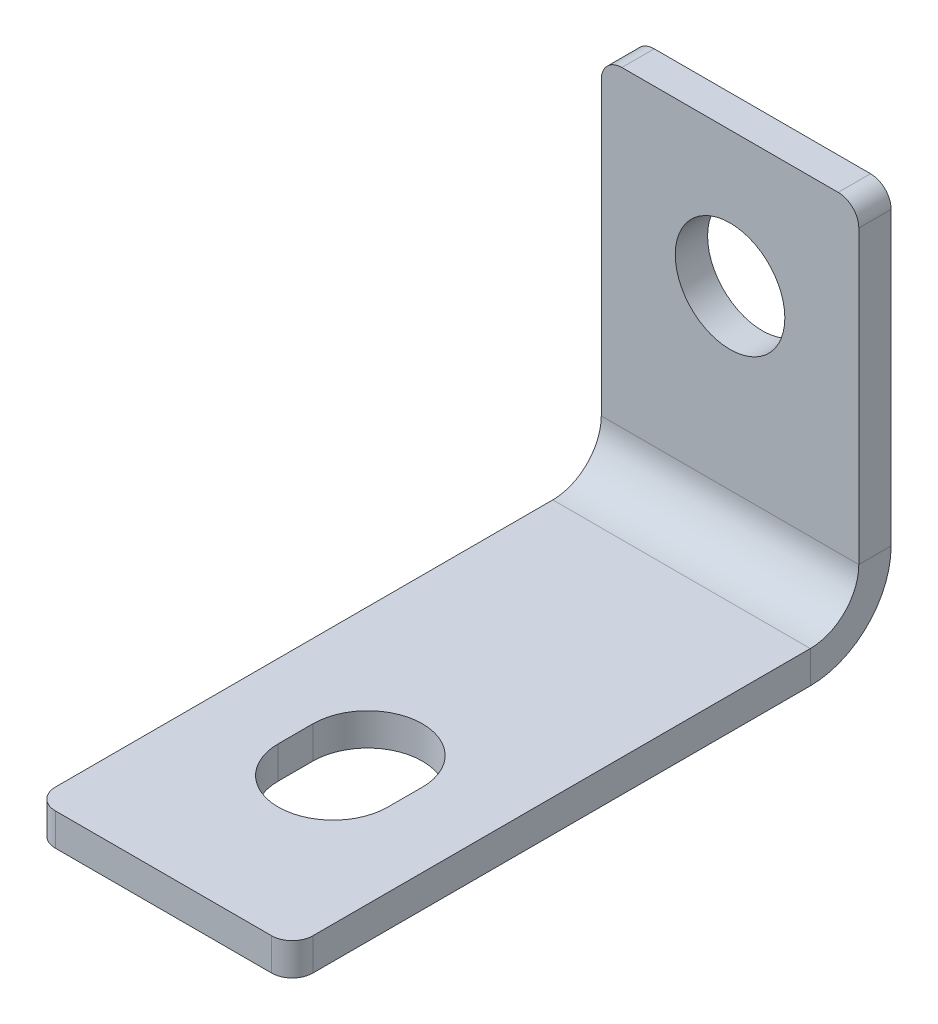
ISO-10303-21;
HEADER;
FILE_DESCRIPTION(('STEP AP214'),'2;1');
FILE_NAME('part.step','',(''),(''),'','','');
FILE_SCHEMA(('AUTOMOTIVE_DESIGN { 1 0 10303 214 1 1 1 1 }'));
ENDSEC;
DATA;
#1=APPLICATION_CONTEXT('core data for automotive mechanical design processes');
#2=APPLICATION_PROTOCOL_DEFINITION('international standard','automotive_design',2000,#1);
#3=PRODUCT_CONTEXT('',#1,'mechanical');
#4=PRODUCT('Part','Part','',(#3));
#5=PRODUCT_RELATED_PRODUCT_CATEGORY('part','',(#4));
#6=PRODUCT_DEFINITION_FORMATION('','',#4);
#7=PRODUCT_DEFINITION_CONTEXT('part definition',#1,'design');
#8=PRODUCT_DEFINITION('design','',#6,#7);
#9=PRODUCT_DEFINITION_SHAPE('','',#8);
#10=(LENGTH_UNIT() NAMED_UNIT(*) SI_UNIT(.MILLI.,.METRE.));
#11=(NAMED_UNIT(*) PLANE_ANGLE_UNIT() SI_UNIT($,.RADIAN.));
#12=(NAMED_UNIT(*) SI_UNIT($,.STERADIAN.) SOLID_ANGLE_UNIT());
#13=UNCERTAINTY_MEASURE_WITH_UNIT(LENGTH_MEASURE(1.E-05),#10,'distance_accuracy_value','');
#14=(GEOMETRIC_REPRESENTATION_CONTEXT(3) GLOBAL_UNCERTAINTY_ASSIGNED_CONTEXT((#13)) GLOBAL_UNIT_ASSIGNED_CONTEXT((#10,
#11,#12)) REPRESENTATION_CONTEXT('',''));
#15=CARTESIAN_POINT('',(0.,0.,0.));
#16=DIRECTION('',(0.,0.,1.));
#17=DIRECTION('',(1.,0.,0.));
#18=AXIS2_PLACEMENT_3D('',#15,#16,#17);
#19=CARTESIAN_POINT('',(15.875,2.99085,0.));
#20=DIRECTION('',(1.,0.,0.));
#21=DIRECTION('',(0.,0.,-1.));
#22=AXIS2_PLACEMENT_3D('',#19,#20,#21);
#23=PLANE('',#22);
#24=DIRECTION('',(0.,0.,-1.));
#25=VECTOR('',#24,1.);
#26=CARTESIAN_POINT('',(15.875,2.99085,0.));
#27=LINE('',#26,#25);
#28=CARTESIAN_POINT('',(15.875,2.99085,0.));
#29=VERTEX_POINT('',#28);
#30=CARTESIAN_POINT('',(15.875,2.99085,-1.9939));
#31=VERTEX_POINT('',#30);
#32=EDGE_CURVE('E334',#29,#31,#27,.T.);
#33=ORIENTED_EDGE('',*,*,#32,.F.);
#34=CARTESIAN_POINT('',(15.875,2.99085,2.99085));
#35=DIRECTION('',(-1.,0.,0.));
#36=DIRECTION('',(0.,0.,1.));
#37=AXIS2_PLACEMENT_3D('',#34,#35,#36);
#38=CIRCLE('',#37,2.99085);
#39=CARTESIAN_POINT('',(15.875,0.,2.99085));
#40=VERTEX_POINT('',#39);
#41=EDGE_CURVE('E279',#40,#29,#38,.F.);
#42=ORIENTED_EDGE('',*,*,#41,.F.);
#43=DIRECTION('',(0.,1.,0.));
#44=VECTOR('',#43,1.);
#45=CARTESIAN_POINT('',(15.875,-1.9939,2.99085000000001));
#46=LINE('',#45,#44);
#47=CARTESIAN_POINT('',(15.875,-1.9939,2.99085000000001));
#48=VERTEX_POINT('',#47);
#49=EDGE_CURVE('E331',#48,#40,#46,.T.);
#50=ORIENTED_EDGE('',*,*,#49,.F.);
#51=CARTESIAN_POINT('',(15.875,2.99085,2.99085));
#52=DIRECTION('',(1.,0.,0.));
#53=DIRECTION('',(0.,0.,-1.));
#54=AXIS2_PLACEMENT_3D('',#51,#52,#53);
#55=CIRCLE('',#54,4.98475);
#56=EDGE_CURVE('E286',#48,#31,#55,.T.);
#57=ORIENTED_EDGE('',*,*,#56,.T.);
#58=EDGE_LOOP('',(#33,#42,#50,#57));
#59=FACE_BOUND('',#58,.T.);
#60=ADVANCED_FACE('F112',(#59),#23,.T.);
#61=CARTESIAN_POINT('',(15.875,-1.9939,2.99085000000001));
#62=DIRECTION('',(1.,0.,0.));
#63=DIRECTION('',(0.,0.,-1.));
#64=AXIS2_PLACEMENT_3D('',#61,#62,#63);
#65=PLANE('',#64);
#66=DIRECTION('',(0.,1.,0.));
#67=VECTOR('',#66,1.);
#68=CARTESIAN_POINT('',(15.875,0.,-1.9939));
#69=LINE('',#68,#67);
#70=CARTESIAN_POINT('',(15.875,20.955,-1.9939));
#71=VERTEX_POINT('',#70);
#72=EDGE_CURVE('E272',#31,#71,#69,.T.);
#73=ORIENTED_EDGE('',*,*,#72,.T.);
#74=DIRECTION('',(0.,0.,-1.));
#75=VECTOR('',#74,1.);
#76=CARTESIAN_POINT('',(15.875,20.955,2.99085000000001));
#77=LINE('',#76,#75);
#78=CARTESIAN_POINT('',(15.875,20.955,0.));
#79=VERTEX_POINT('',#78);
#80=EDGE_CURVE('E345',#71,#79,#77,.F.);
#81=ORIENTED_EDGE('',*,*,#80,.T.);
#82=DIRECTION('',(0.,1.,0.));
#83=VECTOR('',#82,1.);
#84=CARTESIAN_POINT('',(15.875,0.,0.));
#85=LINE('',#84,#83);
#86=EDGE_CURVE('E275',#29,#79,#85,.T.);
#87=ORIENTED_EDGE('',*,*,#86,.F.);
#88=ORIENTED_EDGE('',*,*,#32,.T.);
#89=EDGE_LOOP('',(#73,#81,#87,#88));
#90=FACE_BOUND('',#89,.T.);
#91=ADVANCED_FACE('F404',(#90),#65,.T.);
#92=CARTESIAN_POINT('',(0.,0.,2.99085));
#93=DIRECTION('',(-1.,0.,0.));
#94=DIRECTION('',(0.,0.,1.));
#95=AXIS2_PLACEMENT_3D('',#92,#93,#94);
#96=PLANE('',#95);
#97=DIRECTION('',(0.,-1.,0.));
#98=VECTOR('',#97,1.);
#99=CARTESIAN_POINT('',(0.,0.,2.99085));
#100=LINE('',#99,#98);
#101=CARTESIAN_POINT('',(0.,0.,2.99085));
#102=VERTEX_POINT('',#101);
#103=CARTESIAN_POINT('',(0.,-1.9939,2.99085000000001));
#104=VERTEX_POINT('',#103);
#105=EDGE_CURVE('E328',#102,#104,#100,.T.);
#106=ORIENTED_EDGE('',*,*,#105,.F.);
#107=CARTESIAN_POINT('',(0.,2.99085,2.99085));
#108=DIRECTION('',(-1.,0.,0.));
#109=DIRECTION('',(0.,0.,1.));
#110=AXIS2_PLACEMENT_3D('',#107,#108,#109);
#111=CIRCLE('',#110,2.99085);
#112=CARTESIAN_POINT('',(0.,2.99085,0.));
#113=VERTEX_POINT('',#112);
#114=EDGE_CURVE('E295',#102,#113,#111,.F.);
#115=ORIENTED_EDGE('',*,*,#114,.T.);
#116=DIRECTION('',(0.,0.,1.));
#117=VECTOR('',#116,1.);
#118=CARTESIAN_POINT('',(0.,2.99085,-1.9939));
#119=LINE('',#118,#117);
#120=CARTESIAN_POINT('',(0.,2.99085,-1.9939));
#121=VERTEX_POINT('',#120);
#122=EDGE_CURVE('E326',#121,#113,#119,.T.);
#123=ORIENTED_EDGE('',*,*,#122,.F.);
#124=CARTESIAN_POINT('',(0.,2.99085,2.99085));
#125=DIRECTION('',(1.,0.,0.));
#126=DIRECTION('',(0.,0.,-1.));
#127=AXIS2_PLACEMENT_3D('',#124,#125,#126);
#128=CIRCLE('',#127,4.98475);
#129=EDGE_CURVE('E276',#104,#121,#128,.T.);
#130=ORIENTED_EDGE('',*,*,#129,.F.);
#131=EDGE_LOOP('',(#106,#115,#123,#130));
#132=FACE_BOUND('',#131,.T.);
#133=ADVANCED_FACE('F381',(#132),#96,.T.);
#134=CARTESIAN_POINT('',(0.,2.99085,-1.9939));
#135=DIRECTION('',(-1.,0.,0.));
#136=DIRECTION('',(0.,0.,1.));
#137=AXIS2_PLACEMENT_3D('',#134,#135,#136);
#138=PLANE('',#137);
#139=DIRECTION('',(0.,0.,-1.));
#140=VECTOR('',#139,1.);
#141=CARTESIAN_POINT('',(0.,-1.9939,34.925));
#142=LINE('',#141,#140);
#143=CARTESIAN_POINT('',(0.,-1.9939,33.655));
#144=VERTEX_POINT('',#143);
#145=EDGE_CURVE('E300',#144,#104,#142,.T.);
#146=ORIENTED_EDGE('',*,*,#145,.F.);
#147=DIRECTION('',(0.,1.,0.));
#148=VECTOR('',#147,1.);
#149=CARTESIAN_POINT('',(0.,2.99085,33.655));
#150=LINE('',#149,#148);
#151=CARTESIAN_POINT('',(0.,0.,33.655));
#152=VERTEX_POINT('',#151);
#153=EDGE_CURVE('E120',#144,#152,#150,.T.);
#154=ORIENTED_EDGE('',*,*,#153,.T.);
#155=DIRECTION('',(0.,0.,-1.));
#156=VECTOR('',#155,1.);
#157=CARTESIAN_POINT('',(0.,0.,34.925));
#158=LINE('',#157,#156);
#159=EDGE_CURVE('E298',#152,#102,#158,.T.);
#160=ORIENTED_EDGE('',*,*,#159,.T.);
#161=ORIENTED_EDGE('',*,*,#105,.T.);
#162=EDGE_LOOP('',(#146,#154,#160,#161));
#163=FACE_BOUND('',#162,.T.);
#164=ADVANCED_FACE('F367',(#163),#138,.T.);
#165=CARTESIAN_POINT('',(15.875,0.,-1.9939));
#166=DIRECTION('',(0.,0.,1.));
#167=DIRECTION('',(1.,0.,0.));
#168=AXIS2_PLACEMENT_3D('',#165,#166,#167);
#169=PLANE('',#168);
#170=CARTESIAN_POINT('',(7.9375,13.8811,-1.9939));
#171=DIRECTION('',(0.,0.,-1.));
#172=DIRECTION('',(-1.,0.,0.));
#173=AXIS2_PLACEMENT_3D('',#170,#171,#172);
#174=CIRCLE('',#173,3.37819999999999);
#175=CARTESIAN_POINT('',(4.55930000000001,13.8811,-1.9939));
#176=VERTEX_POINT('',#175);
#177=EDGE_CURVE('E265',#176,#176,#174,.T.);
#178=ORIENTED_EDGE('',*,*,#177,.F.);
#179=EDGE_LOOP('',(#178));
#180=FACE_BOUND('',#179,.T.);
#181=DIRECTION('',(-1.,0.,0.));
#182=VECTOR('',#181,1.);
#183=CARTESIAN_POINT('',(15.875,22.225,-1.9939));
#184=LINE('',#183,#182);
#185=CARTESIAN_POINT('',(14.605,22.225,-1.9939));
#186=VERTEX_POINT('',#185);
#187=CARTESIAN_POINT('',(1.27,22.225,-1.9939));
#188=VERTEX_POINT('',#187);
#189=EDGE_CURVE('E323',#186,#188,#184,.T.);
#190=ORIENTED_EDGE('',*,*,#189,.F.);
#191=CARTESIAN_POINT('',(14.605,20.955,-1.9939));
#192=DIRECTION('',(0.,0.,1.));
#193=DIRECTION('',(1.,0.,0.));
#194=AXIS2_PLACEMENT_3D('',#191,#192,#193);
#195=CIRCLE('',#194,1.27);
#196=EDGE_CURVE('E343',#186,#71,#195,.F.);
#197=ORIENTED_EDGE('',*,*,#196,.T.);
#198=ORIENTED_EDGE('',*,*,#72,.F.);
#199=DIRECTION('',(-1.,0.,0.));
#200=VECTOR('',#199,1.);
#201=CARTESIAN_POINT('',(15.875,2.99085,-1.9939));
#202=LINE('',#201,#200);
#203=EDGE_CURVE('E289',#31,#121,#202,.T.);
#204=ORIENTED_EDGE('',*,*,#203,.T.);
#205=DIRECTION('',(0.,1.,0.));
#206=VECTOR('',#205,1.);
#207=CARTESIAN_POINT('',(0.,0.,-1.9939));
#208=LINE('',#207,#206);
#209=CARTESIAN_POINT('',(0.,20.955,-1.9939));
#210=VERTEX_POINT('',#209);
#211=EDGE_CURVE('E271',#121,#210,#208,.T.);
#212=ORIENTED_EDGE('',*,*,#211,.T.);
#213=CARTESIAN_POINT('',(1.27,20.955,-1.9939));
#214=DIRECTION('',(0.,0.,1.));
#215=DIRECTION('',(1.,0.,0.));
#216=AXIS2_PLACEMENT_3D('',#213,#214,#215);
#217=CIRCLE('',#216,1.27);
#218=EDGE_CURVE('E341',#210,#188,#217,.F.);
#219=ORIENTED_EDGE('',*,*,#218,.T.);
#220=EDGE_LOOP('',(#190,#197,#198,#204,#212,#219));
#221=FACE_BOUND('',#220,.T.);
#222=ADVANCED_FACE('F422',(#180,#221),#169,.F.);
#223=CARTESIAN_POINT('',(15.875,22.225,0.));
#224=DIRECTION('',(0.,1.,0.));
#225=DIRECTION('',(0.,0.,1.));
#226=AXIS2_PLACEMENT_3D('',#223,#224,#225);
#227=PLANE('',#226);
#228=DIRECTION('',(-1.,0.,0.));
#229=VECTOR('',#228,1.);
#230=CARTESIAN_POINT('',(15.875,22.225,0.));
#231=LINE('',#230,#229);
#232=CARTESIAN_POINT('',(14.605,22.225,0.));
#233=VERTEX_POINT('',#232);
#234=CARTESIAN_POINT('',(1.27,22.225,0.));
#235=VERTEX_POINT('',#234);
#236=EDGE_CURVE('E320',#233,#235,#231,.T.);
#237=ORIENTED_EDGE('',*,*,#236,.F.);
#238=DIRECTION('',(0.,0.,-1.));
#239=VECTOR('',#238,1.);
#240=CARTESIAN_POINT('',(14.605,22.225,0.));
#241=LINE('',#240,#239);
#242=EDGE_CURVE('E338',#233,#186,#241,.T.);
#243=ORIENTED_EDGE('',*,*,#242,.T.);
#244=ORIENTED_EDGE('',*,*,#189,.T.);
#245=DIRECTION('',(0.,0.,-1.));
#246=VECTOR('',#245,1.);
#247=CARTESIAN_POINT('',(1.27,22.225,0.));
#248=LINE('',#247,#246);
#249=EDGE_CURVE('E336',#188,#235,#248,.F.);
#250=ORIENTED_EDGE('',*,*,#249,.T.);
#251=EDGE_LOOP('',(#237,#243,#244,#250));
#252=FACE_BOUND('',#251,.T.);
#253=ADVANCED_FACE('F413',(#252),#227,.T.);
#254=CARTESIAN_POINT('',(15.875,0.,0.));
#255=DIRECTION('',(0.,0.,1.));
#256=DIRECTION('',(1.,0.,0.));
#257=AXIS2_PLACEMENT_3D('',#254,#255,#256);
#258=PLANE('',#257);
#259=CARTESIAN_POINT('',(7.9375,13.8811,0.));
#260=DIRECTION('',(0.,0.,1.));
#261=DIRECTION('',(1.,0.,0.));
#262=AXIS2_PLACEMENT_3D('',#259,#260,#261);
#263=CIRCLE('',#262,3.37819999999999);
#264=CARTESIAN_POINT('',(11.3157,13.8811,0.));
#265=VERTEX_POINT('',#264);
#266=EDGE_CURVE('E268',#265,#265,#263,.T.);
#267=ORIENTED_EDGE('',*,*,#266,.F.);
#268=EDGE_LOOP('',(#267));
#269=FACE_BOUND('',#268,.T.);
#270=ORIENTED_EDGE('',*,*,#86,.T.);
#271=CARTESIAN_POINT('',(14.605,20.955,0.));
#272=DIRECTION('',(0.,0.,1.));
#273=DIRECTION('',(1.,0.,0.));
#274=AXIS2_PLACEMENT_3D('',#271,#272,#273);
#275=CIRCLE('',#274,1.27);
#276=EDGE_CURVE('E349',#79,#233,#275,.T.);
#277=ORIENTED_EDGE('',*,*,#276,.T.);
#278=ORIENTED_EDGE('',*,*,#236,.T.);
#279=CARTESIAN_POINT('',(1.27,20.955,0.));
#280=DIRECTION('',(0.,0.,1.));
#281=DIRECTION('',(1.,0.,0.));
#282=AXIS2_PLACEMENT_3D('',#279,#280,#281);
#283=CIRCLE('',#282,1.27);
#284=CARTESIAN_POINT('',(0.,20.955,0.));
#285=VERTEX_POINT('',#284);
#286=EDGE_CURVE('E347',#235,#285,#283,.T.);
#287=ORIENTED_EDGE('',*,*,#286,.T.);
#288=DIRECTION('',(0.,1.,0.));
#289=VECTOR('',#288,1.);
#290=CARTESIAN_POINT('',(0.,0.,0.));
#291=LINE('',#290,#289);
#292=EDGE_CURVE('E292',#113,#285,#291,.T.);
#293=ORIENTED_EDGE('',*,*,#292,.F.);
#294=DIRECTION('',(-1.,0.,0.));
#295=VECTOR('',#294,1.);
#296=CARTESIAN_POINT('',(15.875,2.99085,0.));
#297=LINE('',#296,#295);
#298=EDGE_CURVE('E317',#29,#113,#297,.T.);
#299=ORIENTED_EDGE('',*,*,#298,.F.);
#300=EDGE_LOOP('',(#270,#277,#278,#287,#293,#299));
#301=FACE_BOUND('',#300,.T.);
#302=ADVANCED_FACE('F402',(#269,#301),#258,.T.);
#303=CARTESIAN_POINT('',(15.875,2.99085,2.99085));
#304=DIRECTION('',(-1.,0.,0.));
#305=DIRECTION('',(0.,0.,1.));
#306=AXIS2_PLACEMENT_3D('',#303,#304,#305);
#307=CYLINDRICAL_SURFACE('',#306,2.99085);
#308=ORIENTED_EDGE('',*,*,#114,.F.);
#309=DIRECTION('',(-1.,0.,0.));
#310=VECTOR('',#309,1.);
#311=CARTESIAN_POINT('',(15.875,0.,2.99085));
#312=LINE('',#311,#310);
#313=EDGE_CURVE('E314',#40,#102,#312,.T.);
#314=ORIENTED_EDGE('',*,*,#313,.F.);
#315=ORIENTED_EDGE('',*,*,#41,.T.);
#316=ORIENTED_EDGE('',*,*,#298,.T.);
#317=EDGE_LOOP('',(#308,#314,#315,#316));
#318=FACE_BOUND('',#317,.T.);
#319=ADVANCED_FACE('F377',(#318),#307,.F.);
#320=CARTESIAN_POINT('',(15.875,0.,34.925));
#321=DIRECTION('',(0.,1.,0.));
#322=DIRECTION('',(0.,0.,1.));
#323=AXIS2_PLACEMENT_3D('',#320,#321,#322);
#324=PLANE('',#323);
#325=DIRECTION('',(0.,0.,-1.));
#326=VECTOR('',#325,1.);
#327=CARTESIAN_POINT('',(11.3157,0.,24.4729));
#328=LINE('',#327,#326);
#329=CARTESIAN_POINT('',(11.3157,0.,24.4729));
#330=VERTEX_POINT('',#329);
#331=CARTESIAN_POINT('',(11.3157,0.,22.3393));
#332=VERTEX_POINT('',#331);
#333=EDGE_CURVE('E239',#330,#332,#328,.T.);
#334=ORIENTED_EDGE('',*,*,#333,.F.);
#335=CARTESIAN_POINT('',(7.9375,0.,24.4729));
#336=DIRECTION('',(0.,1.,0.));
#337=DIRECTION('',(0.,0.,1.));
#338=AXIS2_PLACEMENT_3D('',#335,#336,#337);
#339=CIRCLE('',#338,3.37819999999999);
#340=CARTESIAN_POINT('',(4.55930000000004,0.,24.4729));
#341=VERTEX_POINT('',#340);
#342=EDGE_CURVE('E248',#341,#330,#339,.T.);
#343=ORIENTED_EDGE('',*,*,#342,.F.);
#344=DIRECTION('',(0.,0.,-1.));
#345=VECTOR('',#344,1.);
#346=CARTESIAN_POINT('',(4.55930000000002,0.,24.4729));
#347=LINE('',#346,#345);
#348=CARTESIAN_POINT('',(4.55930000000001,0.,22.3393));
#349=VERTEX_POINT('',#348);
#350=EDGE_CURVE('E249',#341,#349,#347,.T.);
#351=ORIENTED_EDGE('',*,*,#350,.T.);
#352=CARTESIAN_POINT('',(7.9375,0.,22.3393));
#353=DIRECTION('',(0.,1.,0.));
#354=DIRECTION('',(0.,0.,1.));
#355=AXIS2_PLACEMENT_3D('',#352,#353,#354);
#356=CIRCLE('',#355,3.37819999999999);
#357=EDGE_CURVE('E258',#332,#349,#356,.T.);
#358=ORIENTED_EDGE('',*,*,#357,.F.);
#359=EDGE_LOOP('',(#334,#343,#351,#358));
#360=FACE_BOUND('',#359,.T.);
#361=DIRECTION('',(-1.,0.,0.));
#362=VECTOR('',#361,1.);
#363=CARTESIAN_POINT('',(15.875,0.,34.925));
#364=LINE('',#363,#362);
#365=CARTESIAN_POINT('',(14.605,0.,34.925));
#366=VERTEX_POINT('',#365);
#367=CARTESIAN_POINT('',(1.27,0.,34.925));
#368=VERTEX_POINT('',#367);
#369=EDGE_CURVE('E311',#366,#368,#364,.T.);
#370=ORIENTED_EDGE('',*,*,#369,.F.);
#371=CARTESIAN_POINT('',(14.605,0.,33.655));
#372=DIRECTION('',(0.,1.,0.));
#373=DIRECTION('',(0.,0.,1.));
#374=AXIS2_PLACEMENT_3D('',#371,#372,#373);
#375=CIRCLE('',#374,1.27);
#376=CARTESIAN_POINT('',(15.875,0.,33.655));
#377=VERTEX_POINT('',#376);
#378=EDGE_CURVE('E358',#366,#377,#375,.T.);
#379=ORIENTED_EDGE('',*,*,#378,.T.);
#380=DIRECTION('',(0.,0.,-1.));
#381=VECTOR('',#380,1.);
#382=CARTESIAN_POINT('',(15.875,0.,34.925));
#383=LINE('',#382,#381);
#384=EDGE_CURVE('E282',#377,#40,#383,.T.);
#385=ORIENTED_EDGE('',*,*,#384,.T.);
#386=ORIENTED_EDGE('',*,*,#313,.T.);
#387=ORIENTED_EDGE('',*,*,#159,.F.);
#388=CARTESIAN_POINT('',(1.27,0.,33.655));
#389=DIRECTION('',(0.,1.,0.));
#390=DIRECTION('',(0.,0.,1.));
#391=AXIS2_PLACEMENT_3D('',#388,#389,#390);
#392=CIRCLE('',#391,1.27);
#393=EDGE_CURVE('E356',#152,#368,#392,.T.);
#394=ORIENTED_EDGE('',*,*,#393,.T.);
#395=EDGE_LOOP('',(#370,#379,#385,#386,#387,#394));
#396=FACE_BOUND('',#395,.T.);
#397=ADVANCED_FACE('F372',(#360,#396),#324,.T.);
#398=CARTESIAN_POINT('',(15.875,-1.9939,34.925));
#399=DIRECTION('',(0.,0.,1.));
#400=DIRECTION('',(1.,0.,0.));
#401=AXIS2_PLACEMENT_3D('',#398,#399,#400);
#402=PLANE('',#401);
#403=DIRECTION('',(-1.,0.,0.));
#404=VECTOR('',#403,1.);
#405=CARTESIAN_POINT('',(15.875,-1.9939,34.925));
#406=LINE('',#405,#404);
#407=CARTESIAN_POINT('',(14.605,-1.9939,34.925));
#408=VERTEX_POINT('',#407);
#409=CARTESIAN_POINT('',(1.27,-1.9939,34.925));
#410=VERTEX_POINT('',#409);
#411=EDGE_CURVE('E309',#408,#410,#406,.T.);
#412=ORIENTED_EDGE('',*,*,#411,.F.);
#413=DIRECTION('',(0.,1.,0.));
#414=VECTOR('',#413,1.);
#415=CARTESIAN_POINT('',(14.605,0.,34.925));
#416=LINE('',#415,#414);
#417=EDGE_CURVE('E353',#408,#366,#416,.T.);
#418=ORIENTED_EDGE('',*,*,#417,.T.);
#419=ORIENTED_EDGE('',*,*,#369,.T.);
#420=DIRECTION('',(0.,1.,0.));
#421=VECTOR('',#420,1.);
#422=CARTESIAN_POINT('',(1.27,-1.9939,34.925));
#423=LINE('',#422,#421);
#424=EDGE_CURVE('E351',#368,#410,#423,.F.);
#425=ORIENTED_EDGE('',*,*,#424,.T.);
#426=EDGE_LOOP('',(#412,#418,#419,#425));
#427=FACE_BOUND('',#426,.T.);
#428=ADVANCED_FACE('F395',(#427),#402,.T.);
#429=CARTESIAN_POINT('',(15.875,-1.9939,34.925));
#430=DIRECTION('',(0.,1.,0.));
#431=DIRECTION('',(0.,0.,1.));
#432=AXIS2_PLACEMENT_3D('',#429,#430,#431);
#433=PLANE('',#432);
#434=DIRECTION('',(0.,0.,-1.));
#435=VECTOR('',#434,1.);
#436=CARTESIAN_POINT('',(4.55930000000001,-1.9939,24.4729));
#437=LINE('',#436,#435);
#438=CARTESIAN_POINT('',(4.5593,-1.9939,24.4729));
#439=VERTEX_POINT('',#438);
#440=CARTESIAN_POINT('',(4.55930000000001,-1.9939,22.3393));
#441=VERTEX_POINT('',#440);
#442=EDGE_CURVE('E238',#439,#441,#437,.T.);
#443=ORIENTED_EDGE('',*,*,#442,.F.);
#444=CARTESIAN_POINT('',(7.9375,-1.9939,24.4729));
#445=DIRECTION('',(0.,1.,0.));
#446=DIRECTION('',(0.,0.,1.));
#447=AXIS2_PLACEMENT_3D('',#444,#445,#446);
#448=CIRCLE('',#447,3.3782);
#449=CARTESIAN_POINT('',(11.3157,-1.9939,24.4729));
#450=VERTEX_POINT('',#449);
#451=EDGE_CURVE('E245',#439,#450,#448,.T.);
#452=ORIENTED_EDGE('',*,*,#451,.T.);
#453=DIRECTION('',(0.,0.,-1.));
#454=VECTOR('',#453,1.);
#455=CARTESIAN_POINT('',(11.3157,-1.9939,24.4729));
#456=LINE('',#455,#454);
#457=CARTESIAN_POINT('',(11.3157,-1.9939,22.3393));
#458=VERTEX_POINT('',#457);
#459=EDGE_CURVE('E227',#450,#458,#456,.T.);
#460=ORIENTED_EDGE('',*,*,#459,.T.);
#461=CARTESIAN_POINT('',(7.9375,-1.9939,22.3393));
#462=DIRECTION('',(0.,1.,0.));
#463=DIRECTION('',(0.,0.,1.));
#464=AXIS2_PLACEMENT_3D('',#461,#462,#463);
#465=CIRCLE('',#464,3.3782);
#466=EDGE_CURVE('E260',#458,#441,#465,.T.);
#467=ORIENTED_EDGE('',*,*,#466,.T.);
#468=EDGE_LOOP('',(#443,#452,#460,#467));
#469=FACE_BOUND('',#468,.T.);
#470=DIRECTION('',(0.,0.,-1.));
#471=VECTOR('',#470,1.);
#472=CARTESIAN_POINT('',(15.875,-1.9939,34.925));
#473=LINE('',#472,#471);
#474=CARTESIAN_POINT('',(15.875,-1.9939,33.655));
#475=VERTEX_POINT('',#474);
#476=EDGE_CURVE('E284',#475,#48,#473,.T.);
#477=ORIENTED_EDGE('',*,*,#476,.F.);
#478=CARTESIAN_POINT('',(14.605,-1.9939,33.655));
#479=DIRECTION('',(0.,1.,0.));
#480=DIRECTION('',(0.,0.,1.));
#481=AXIS2_PLACEMENT_3D('',#478,#479,#480);
#482=CIRCLE('',#481,1.27);
#483=EDGE_CURVE('E362',#475,#408,#482,.F.);
#484=ORIENTED_EDGE('',*,*,#483,.T.);
#485=ORIENTED_EDGE('',*,*,#411,.T.);
#486=CARTESIAN_POINT('',(1.27,-1.9939,33.655));
#487=DIRECTION('',(0.,1.,0.));
#488=DIRECTION('',(0.,0.,1.));
#489=AXIS2_PLACEMENT_3D('',#486,#487,#488);
#490=CIRCLE('',#489,1.27);
#491=EDGE_CURVE('E127',#410,#144,#490,.F.);
#492=ORIENTED_EDGE('',*,*,#491,.T.);
#493=ORIENTED_EDGE('',*,*,#145,.T.);
#494=DIRECTION('',(-1.,0.,0.));
#495=VECTOR('',#494,1.);
#496=CARTESIAN_POINT('',(15.875,-1.9939,2.99085000000001));
#497=LINE('',#496,#495);
#498=EDGE_CURVE('E306',#48,#104,#497,.T.);
#499=ORIENTED_EDGE('',*,*,#498,.F.);
#500=EDGE_LOOP('',(#477,#484,#485,#492,#493,#499));
#501=FACE_BOUND('',#500,.T.);
#502=ADVANCED_FACE('F251',(#469,#501),#433,.F.);
#503=CARTESIAN_POINT('',(15.875,2.99085,2.99085));
#504=DIRECTION('',(-1.,0.,0.));
#505=DIRECTION('',(0.,0.,1.));
#506=AXIS2_PLACEMENT_3D('',#503,#504,#505);
#507=CYLINDRICAL_SURFACE('',#506,4.98475);
#508=ORIENTED_EDGE('',*,*,#129,.T.);
#509=ORIENTED_EDGE('',*,*,#203,.F.);
#510=ORIENTED_EDGE('',*,*,#56,.F.);
#511=ORIENTED_EDGE('',*,*,#498,.T.);
#512=EDGE_LOOP('',(#508,#509,#510,#511));
#513=FACE_BOUND('',#512,.T.);
#514=ADVANCED_FACE('F386',(#513),#507,.T.);
#515=CARTESIAN_POINT('',(15.875,2.99085,2.99085));
#516=DIRECTION('',(-1.,0.,0.));
#517=DIRECTION('',(0.,0.,1.));
#518=AXIS2_PLACEMENT_3D('',#515,#516,#517);
#519=PLANE('',#518);
#520=ORIENTED_EDGE('',*,*,#384,.F.);
#521=DIRECTION('',(0.,1.,0.));
#522=VECTOR('',#521,1.);
#523=CARTESIAN_POINT('',(15.875,-1.9939,33.655));
#524=LINE('',#523,#522);
#525=EDGE_CURVE('E135',#377,#475,#524,.F.);
#526=ORIENTED_EDGE('',*,*,#525,.T.);
#527=ORIENTED_EDGE('',*,*,#476,.T.);
#528=ORIENTED_EDGE('',*,*,#49,.T.);
#529=EDGE_LOOP('',(#520,#526,#527,#528));
#530=FACE_BOUND('',#529,.T.);
#531=ADVANCED_FACE('F397',(#530),#519,.F.);
#532=CARTESIAN_POINT('',(0.,2.99085,2.99085));
#533=DIRECTION('',(-1.,0.,0.));
#534=DIRECTION('',(0.,0.,1.));
#535=AXIS2_PLACEMENT_3D('',#532,#533,#534);
#536=PLANE('',#535);
#537=ORIENTED_EDGE('',*,*,#292,.T.);
#538=DIRECTION('',(0.,0.,-1.));
#539=VECTOR('',#538,1.);
#540=CARTESIAN_POINT('',(0.,20.955,2.99085));
#541=LINE('',#540,#539);
#542=EDGE_CURVE('E13',#285,#210,#541,.T.);
#543=ORIENTED_EDGE('',*,*,#542,.T.);
#544=ORIENTED_EDGE('',*,*,#211,.F.);
#545=ORIENTED_EDGE('',*,*,#122,.T.);
#546=EDGE_LOOP('',(#537,#543,#544,#545));
#547=FACE_BOUND('',#546,.T.);
#548=ADVANCED_FACE('F419',(#547),#536,.T.);
#549=CARTESIAN_POINT('',(7.9375,13.8811,-1.9939));
#550=DIRECTION('',(0.,0.,-1.));
#551=DIRECTION('',(-1.,0.,0.));
#552=AXIS2_PLACEMENT_3D('',#549,#550,#551);
#553=CYLINDRICAL_SURFACE('',#552,3.37819999999999);
#554=ORIENTED_EDGE('',*,*,#266,.T.);
#555=EDGE_LOOP('',(#554));
#556=FACE_BOUND('',#555,.T.);
#557=ORIENTED_EDGE('',*,*,#177,.T.);
#558=EDGE_LOOP('',(#557));
#559=FACE_BOUND('',#558,.T.);
#560=ADVANCED_FACE('F478',(#556,#559),#553,.F.);
#561=CARTESIAN_POINT('',(7.9375,0.,22.3393));
#562=DIRECTION('',(0.,1.,0.));
#563=DIRECTION('',(0.,0.,1.));
#564=AXIS2_PLACEMENT_3D('',#561,#562,#563);
#565=CYLINDRICAL_SURFACE('',#564,3.37819999999999);
#566=ORIENTED_EDGE('',*,*,#466,.F.);
#567=DIRECTION('',(0.,-1.,0.));
#568=VECTOR('',#567,1.);
#569=CARTESIAN_POINT('',(11.3157,-1.9939,22.3393));
#570=LINE('',#569,#568);
#571=EDGE_CURVE('E233',#332,#458,#570,.T.);
#572=ORIENTED_EDGE('',*,*,#571,.F.);
#573=ORIENTED_EDGE('',*,*,#357,.T.);
#574=DIRECTION('',(0.,1.,0.));
#575=VECTOR('',#574,1.);
#576=CARTESIAN_POINT('',(4.55930000000001,0.,22.3393));
#577=LINE('',#576,#575);
#578=EDGE_CURVE('E262',#441,#349,#577,.T.);
#579=ORIENTED_EDGE('',*,*,#578,.F.);
#580=EDGE_LOOP('',(#566,#572,#573,#579));
#581=FACE_BOUND('',#580,.T.);
#582=ADVANCED_FACE('F586',(#581),#565,.F.);
#583=CARTESIAN_POINT('',(7.9375,0.,24.4729));
#584=DIRECTION('',(0.,1.,0.));
#585=DIRECTION('',(0.,0.,1.));
#586=AXIS2_PLACEMENT_3D('',#583,#584,#585);
#587=CYLINDRICAL_SURFACE('',#586,3.37819999999999);
#588=ORIENTED_EDGE('',*,*,#342,.T.);
#589=DIRECTION('',(0.,-1.,0.));
#590=VECTOR('',#589,1.);
#591=CARTESIAN_POINT('',(11.3157,-1.9939,24.4729));
#592=LINE('',#591,#590);
#593=EDGE_CURVE('E230',#330,#450,#592,.T.);
#594=ORIENTED_EDGE('',*,*,#593,.T.);
#595=ORIENTED_EDGE('',*,*,#451,.F.);
#596=DIRECTION('',(0.,1.,0.));
#597=VECTOR('',#596,1.);
#598=CARTESIAN_POINT('',(4.55930000000001,0.,24.4729));
#599=LINE('',#598,#597);
#600=EDGE_CURVE('E252',#341,#439,#599,.F.);
#601=ORIENTED_EDGE('',*,*,#600,.F.);
#602=EDGE_LOOP('',(#588,#594,#595,#601));
#603=FACE_BOUND('',#602,.T.);
#604=ADVANCED_FACE('F243',(#603),#587,.F.);
#605=CARTESIAN_POINT('',(4.55930000000001,0.,24.4729));
#606=DIRECTION('',(-1.,0.,0.));
#607=DIRECTION('',(0.,0.,1.));
#608=AXIS2_PLACEMENT_3D('',#605,#606,#607);
#609=PLANE('',#608);
#610=ORIENTED_EDGE('',*,*,#578,.T.);
#611=ORIENTED_EDGE('',*,*,#350,.F.);
#612=ORIENTED_EDGE('',*,*,#600,.T.);
#613=ORIENTED_EDGE('',*,*,#442,.T.);
#614=EDGE_LOOP('',(#610,#611,#612,#613));
#615=FACE_BOUND('',#614,.T.);
#616=ADVANCED_FACE('F568',(#615),#609,.F.);
#617=CARTESIAN_POINT('',(11.3157,-1.9939,24.4729));
#618=DIRECTION('',(1.,0.,0.));
#619=DIRECTION('',(0.,1.,0.));
#620=AXIS2_PLACEMENT_3D('',#617,#618,#619);
#621=PLANE('',#620);
#622=ORIENTED_EDGE('',*,*,#571,.T.);
#623=ORIENTED_EDGE('',*,*,#459,.F.);
#624=ORIENTED_EDGE('',*,*,#593,.F.);
#625=ORIENTED_EDGE('',*,*,#333,.T.);
#626=EDGE_LOOP('',(#622,#623,#624,#625));
#627=FACE_BOUND('',#626,.T.);
#628=ADVANCED_FACE('F229',(#627),#621,.F.);
#629=CARTESIAN_POINT('',(14.605,20.955,0.));
#630=DIRECTION('',(0.,0.,-1.));
#631=DIRECTION('',(-1.,0.,0.));
#632=AXIS2_PLACEMENT_3D('',#629,#630,#631);
#633=CYLINDRICAL_SURFACE('',#632,1.27);
#634=ORIENTED_EDGE('',*,*,#276,.F.);
#635=ORIENTED_EDGE('',*,*,#80,.F.);
#636=ORIENTED_EDGE('',*,*,#196,.F.);
#637=ORIENTED_EDGE('',*,*,#242,.F.);
#638=EDGE_LOOP('',(#634,#635,#636,#637));
#639=FACE_BOUND('',#638,.T.);
#640=ADVANCED_FACE('F408',(#639),#633,.T.);
#641=CARTESIAN_POINT('',(14.605,-1.9939,33.655));
#642=DIRECTION('',(0.,-1.,0.));
#643=DIRECTION('',(0.,0.,-1.));
#644=AXIS2_PLACEMENT_3D('',#641,#642,#643);
#645=CYLINDRICAL_SURFACE('',#644,1.27);
#646=ORIENTED_EDGE('',*,*,#483,.F.);
#647=ORIENTED_EDGE('',*,*,#525,.F.);
#648=ORIENTED_EDGE('',*,*,#378,.F.);
#649=ORIENTED_EDGE('',*,*,#417,.F.);
#650=EDGE_LOOP('',(#646,#647,#648,#649));
#651=FACE_BOUND('',#650,.T.);
#652=ADVANCED_FACE('F393',(#651),#645,.T.);
#653=CARTESIAN_POINT('',(1.27,2.99085,33.655));
#654=DIRECTION('',(0.,1.,0.));
#655=DIRECTION('',(0.,0.,1.));
#656=AXIS2_PLACEMENT_3D('',#653,#654,#655);
#657=CYLINDRICAL_SURFACE('',#656,1.27);
#658=ORIENTED_EDGE('',*,*,#491,.F.);
#659=ORIENTED_EDGE('',*,*,#424,.F.);
#660=ORIENTED_EDGE('',*,*,#393,.F.);
#661=ORIENTED_EDGE('',*,*,#153,.F.);
#662=EDGE_LOOP('',(#658,#659,#660,#661));
#663=FACE_BOUND('',#662,.T.);
#664=ADVANCED_FACE('F444',(#663),#657,.T.);
#665=CARTESIAN_POINT('',(1.27,20.955,2.99085));
#666=DIRECTION('',(0.,0.,-1.));
#667=DIRECTION('',(-1.,0.,0.));
#668=AXIS2_PLACEMENT_3D('',#665,#666,#667);
#669=CYLINDRICAL_SURFACE('',#668,1.27);
#670=ORIENTED_EDGE('',*,*,#286,.F.);
#671=ORIENTED_EDGE('',*,*,#249,.F.);
#672=ORIENTED_EDGE('',*,*,#218,.F.);
#673=ORIENTED_EDGE('',*,*,#542,.F.);
#674=EDGE_LOOP('',(#670,#671,#672,#673));
#675=FACE_BOUND('',#674,.T.);
#676=ADVANCED_FACE('F114',(#675),#669,.T.);
#677=CLOSED_SHELL('',(#60,#91,#133,#164,#222,#253,#302,#319,#397,#428,#502,#514,#531,#548,#560,
#582,#604,#616,#628,#640,#652,#664,#676));
#678=MANIFOLD_SOLID_BREP('B2',#677);
#679=ADVANCED_BREP_SHAPE_REPRESENTATION('',(#18,#678),#14);
#680=SHAPE_DEFINITION_REPRESENTATION(#9,#679);
ENDSEC;
END-ISO-10303-21;
